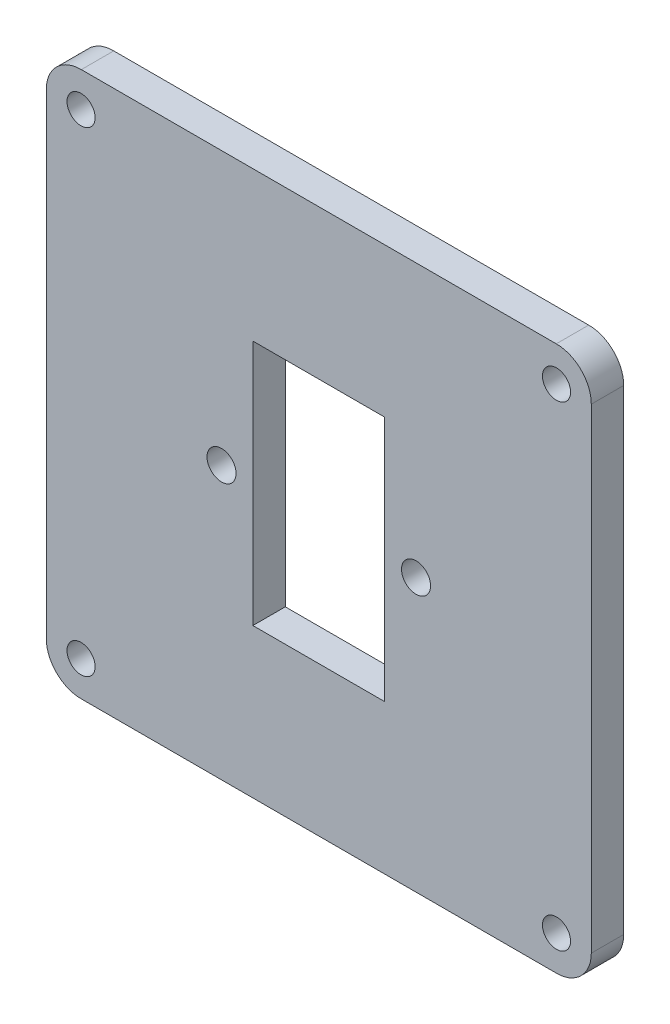
ISO-10303-21;
HEADER;
FILE_DESCRIPTION(('STEP AP214'),'2;1');
FILE_NAME('part.step','',(''),(''),'','','');
FILE_SCHEMA(('AUTOMOTIVE_DESIGN { 1 0 10303 214 1 1 1 1 }'));
ENDSEC;
DATA;
#1=APPLICATION_CONTEXT('core data for automotive mechanical design processes');
#2=APPLICATION_PROTOCOL_DEFINITION('international standard','automotive_design',2000,#1);
#3=PRODUCT_CONTEXT('',#1,'mechanical');
#4=PRODUCT('Part','Part','',(#3));
#5=PRODUCT_RELATED_PRODUCT_CATEGORY('part','',(#4));
#6=PRODUCT_DEFINITION_FORMATION('','',#4);
#7=PRODUCT_DEFINITION_CONTEXT('part definition',#1,'design');
#8=PRODUCT_DEFINITION('design','',#6,#7);
#9=PRODUCT_DEFINITION_SHAPE('','',#8);
#10=(LENGTH_UNIT() NAMED_UNIT(*) SI_UNIT(.MILLI.,.METRE.));
#11=(NAMED_UNIT(*) PLANE_ANGLE_UNIT() SI_UNIT($,.RADIAN.));
#12=(NAMED_UNIT(*) SI_UNIT($,.STERADIAN.) SOLID_ANGLE_UNIT());
#13=UNCERTAINTY_MEASURE_WITH_UNIT(LENGTH_MEASURE(1.E-05),#10,'distance_accuracy_value','');
#14=(GEOMETRIC_REPRESENTATION_CONTEXT(3) GLOBAL_UNCERTAINTY_ASSIGNED_CONTEXT((#13)) GLOBAL_UNIT_ASSIGNED_CONTEXT((#10,
#11,#12)) REPRESENTATION_CONTEXT('',''));
#15=CARTESIAN_POINT('',(0.,0.,0.));
#16=DIRECTION('',(0.,0.,1.));
#17=DIRECTION('',(1.,0.,0.));
#18=AXIS2_PLACEMENT_3D('',#15,#16,#17);
#19=CARTESIAN_POINT('',(69.6162883186586,65.8717779248072,3.));
#20=DIRECTION('',(0.,0.,1.));
#21=DIRECTION('',(1.,0.,0.));
#22=AXIS2_PLACEMENT_3D('',#19,#20,#21);
#23=PLANE('',#22);
#24=CARTESIAN_POINT('',(25.6162883186587,21.8717779248072,3.));
#25=DIRECTION('',(0.,0.,1.));
#26=DIRECTION('',(1.,0.,0.));
#27=AXIS2_PLACEMENT_3D('',#24,#25,#26);
#28=CIRCLE('',#27,1.3);
#29=CARTESIAN_POINT('',(26.9162883186587,21.8717779248072,3.));
#30=VERTEX_POINT('',#29);
#31=EDGE_CURVE('E166',#30,#30,#28,.T.);
#32=ORIENTED_EDGE('',*,*,#31,.F.);
#33=EDGE_LOOP('',(#32));
#34=FACE_BOUND('',#33,.T.);
#35=CARTESIAN_POINT('',(56.6162923684504,43.8721389086082,3.));
#36=DIRECTION('',(0.,0.,1.));
#37=DIRECTION('',(1.,0.,0.));
#38=AXIS2_PLACEMENT_3D('',#35,#36,#37);
#39=CIRCLE('',#38,1.34406779658843);
#40=CARTESIAN_POINT('',(57.9603601650388,43.8721389086082,3.));
#41=VERTEX_POINT('',#40);
#42=EDGE_CURVE('E178',#41,#41,#39,.T.);
#43=ORIENTED_EDGE('',*,*,#42,.F.);
#44=EDGE_LOOP('',(#43));
#45=FACE_BOUND('',#44,.T.);
#46=CARTESIAN_POINT('',(25.6162883186587,65.8717779248072,3.));
#47=DIRECTION('',(0.,0.,1.));
#48=DIRECTION('',(1.,0.,0.));
#49=AXIS2_PLACEMENT_3D('',#46,#47,#48);
#50=CIRCLE('',#49,1.3);
#51=CARTESIAN_POINT('',(26.9162883186587,65.8717779248072,3.));
#52=VERTEX_POINT('',#51);
#53=EDGE_CURVE('E190',#52,#52,#50,.T.);
#54=ORIENTED_EDGE('',*,*,#53,.F.);
#55=EDGE_LOOP('',(#54));
#56=FACE_BOUND('',#55,.T.);
#57=CARTESIAN_POINT('',(69.6162883186586,65.8717779248072,3.));
#58=DIRECTION('',(0.,0.,1.));
#59=DIRECTION('',(1.,0.,0.));
#60=AXIS2_PLACEMENT_3D('',#57,#58,#59);
#61=CIRCLE('',#60,3.21791539875967);
#62=CARTESIAN_POINT('',(72.8342036947718,65.8721596961835,3.));
#63=VERTEX_POINT('',#62);
#64=CARTESIAN_POINT('',(69.5928177896237,69.0896077288586,3.));
#65=VERTEX_POINT('',#64);
#66=EDGE_CURVE('E196',#63,#65,#61,.T.);
#67=ORIENTED_EDGE('',*,*,#66,.T.);
#68=DIRECTION('',(-1.,0.,0.));
#69=VECTOR('',#68,1.);
#70=CARTESIAN_POINT('',(25.6397669472783,69.0896077288586,3.));
#71=LINE('',#70,#69);
#72=CARTESIAN_POINT('',(25.6397669472783,69.0896077288586,3.));
#73=VERTEX_POINT('',#72);
#74=EDGE_CURVE('E199',#65,#73,#71,.T.);
#75=ORIENTED_EDGE('',*,*,#74,.T.);
#76=CARTESIAN_POINT('',(25.6162883186587,65.8717779248072,3.));
#77=DIRECTION('',(0.,0.,1.));
#78=DIRECTION('',(1.,0.,0.));
#79=AXIS2_PLACEMENT_3D('',#76,#77,#78);
#80=CIRCLE('',#79,3.21791545784586);
#81=CARTESIAN_POINT('',(22.3983728810603,65.8721389086082,3.));
#82=VERTEX_POINT('',#81);
#83=EDGE_CURVE('E202',#73,#82,#80,.T.);
#84=ORIENTED_EDGE('',*,*,#83,.T.);
#85=DIRECTION('',(0.,-1.,0.));
#86=VECTOR('',#85,1.);
#87=CARTESIAN_POINT('',(22.3983728810603,21.8721389086082,3.));
#88=LINE('',#87,#86);
#89=CARTESIAN_POINT('',(22.3983728810603,21.8721389086082,3.));
#90=VERTEX_POINT('',#89);
#91=EDGE_CURVE('E204',#82,#90,#88,.T.);
#92=ORIENTED_EDGE('',*,*,#91,.T.);
#93=CARTESIAN_POINT('',(25.6162883186587,21.8717779248072,3.));
#94=DIRECTION('',(0.,0.,1.));
#95=DIRECTION('',(1.,0.,0.));
#96=AXIS2_PLACEMENT_3D('',#93,#94,#95);
#97=CIRCLE('',#96,3.21791545784585);
#98=CARTESIAN_POINT('',(25.6416198760061,18.6539621740151,3.));
#99=VERTEX_POINT('',#98);
#100=EDGE_CURVE('E206',#90,#99,#97,.T.);
#101=ORIENTED_EDGE('',*,*,#100,.T.);
#102=DIRECTION('',(1.,0.,0.));
#103=VECTOR('',#102,1.);
#104=CARTESIAN_POINT('',(69.590964860896,18.6539621740151,3.));
#105=LINE('',#104,#103);
#106=CARTESIAN_POINT('',(69.590964860896,18.6539621740151,3.));
#107=VERTEX_POINT('',#106);
#108=EDGE_CURVE('E208',#99,#107,#105,.T.);
#109=ORIENTED_EDGE('',*,*,#108,.T.);
#110=CARTESIAN_POINT('',(69.6162883186587,21.8717779248072,3.));
#111=DIRECTION('',(0.,0.,1.));
#112=DIRECTION('',(1.,0.,0.));
#113=AXIS2_PLACEMENT_3D('',#110,#111,#112);
#114=CIRCLE('',#113,3.21791539409579);
#115=CARTESIAN_POINT('',(72.8342036947718,21.8721181210328,3.));
#116=VERTEX_POINT('',#115);
#117=EDGE_CURVE('E210',#107,#116,#114,.T.);
#118=ORIENTED_EDGE('',*,*,#117,.T.);
#119=DIRECTION('',(0.,1.,0.));
#120=VECTOR('',#119,1.);
#121=CARTESIAN_POINT('',(72.8342036947718,21.8721181210328,3.));
#122=LINE('',#121,#120);
#123=EDGE_CURVE('E212',#116,#63,#122,.T.);
#124=ORIENTED_EDGE('',*,*,#123,.T.);
#125=EDGE_LOOP('',(#67,#75,#84,#92,#101,#109,#118,#124));
#126=FACE_BOUND('',#125,.T.);
#127=CARTESIAN_POINT('',(69.6162883186586,65.8717779248072,3.));
#128=DIRECTION('',(0.,0.,1.));
#129=DIRECTION('',(1.,0.,0.));
#130=AXIS2_PLACEMENT_3D('',#127,#128,#129);
#131=CIRCLE('',#130,1.29999999999999);
#132=CARTESIAN_POINT('',(70.9162883186586,65.8717779248072,3.));
#133=VERTEX_POINT('',#132);
#134=EDGE_CURVE('E184',#133,#133,#131,.T.);
#135=ORIENTED_EDGE('',*,*,#134,.F.);
#136=EDGE_LOOP('',(#135));
#137=FACE_BOUND('',#136,.T.);
#138=CARTESIAN_POINT('',(38.6162923684504,43.8721389086082,3.));
#139=DIRECTION('',(0.,0.,1.));
#140=DIRECTION('',(1.,0.,0.));
#141=AXIS2_PLACEMENT_3D('',#138,#139,#140);
#142=CIRCLE('',#141,1.34406779658843);
#143=CARTESIAN_POINT('',(39.9603601650388,43.8721389086082,3.));
#144=VERTEX_POINT('',#143);
#145=EDGE_CURVE('E172',#144,#144,#142,.T.);
#146=ORIENTED_EDGE('',*,*,#145,.F.);
#147=EDGE_LOOP('',(#146));
#148=FACE_BOUND('',#147,.T.);
#149=CARTESIAN_POINT('',(69.6162883186587,21.8717779248072,3.));
#150=DIRECTION('',(0.,0.,1.));
#151=DIRECTION('',(1.,0.,0.));
#152=AXIS2_PLACEMENT_3D('',#149,#150,#151);
#153=CIRCLE('',#152,1.29999999999999);
#154=CARTESIAN_POINT('',(70.9162883186587,21.8717779248072,3.));
#155=VERTEX_POINT('',#154);
#156=EDGE_CURVE('E160',#155,#155,#153,.T.);
#157=ORIENTED_EDGE('',*,*,#156,.F.);
#158=EDGE_LOOP('',(#157));
#159=FACE_BOUND('',#158,.T.);
#160=DIRECTION('',(1.,0.,0.));
#161=VECTOR('',#160,1.);
#162=CARTESIAN_POINT('',(53.7162923684504,32.4721389086082,3.));
#163=LINE('',#162,#161);
#164=CARTESIAN_POINT('',(41.5162923684504,32.4721389086082,3.));
#165=VERTEX_POINT('',#164);
#166=CARTESIAN_POINT('',(53.7162923684504,32.4721389086082,3.));
#167=VERTEX_POINT('',#166);
#168=EDGE_CURVE('E132',#165,#167,#163,.T.);
#169=ORIENTED_EDGE('',*,*,#168,.F.);
#170=DIRECTION('',(0.,-1.,0.));
#171=VECTOR('',#170,1.);
#172=CARTESIAN_POINT('',(41.5162923684504,32.4721389086082,3.));
#173=LINE('',#172,#171);
#174=CARTESIAN_POINT('',(41.5162923684504,55.2721389086082,3.));
#175=VERTEX_POINT('',#174);
#176=EDGE_CURVE('E124',#175,#165,#173,.T.);
#177=ORIENTED_EDGE('',*,*,#176,.F.);
#178=DIRECTION('',(-1.,0.,0.));
#179=VECTOR('',#178,1.);
#180=CARTESIAN_POINT('',(41.5162923684504,55.2721389086082,3.));
#181=LINE('',#180,#179);
#182=CARTESIAN_POINT('',(53.7162923684504,55.2721389086082,3.));
#183=VERTEX_POINT('',#182);
#184=EDGE_CURVE('E146',#183,#175,#181,.T.);
#185=ORIENTED_EDGE('',*,*,#184,.F.);
#186=DIRECTION('',(0.,1.,0.));
#187=VECTOR('',#186,1.);
#188=CARTESIAN_POINT('',(53.7162923684504,55.2721389086082,3.));
#189=LINE('',#188,#187);
#190=EDGE_CURVE('E144',#167,#183,#189,.T.);
#191=ORIENTED_EDGE('',*,*,#190,.F.);
#192=EDGE_LOOP('',(#169,#177,#185,#191));
#193=FACE_BOUND('',#192,.T.);
#194=ADVANCED_FACE('F35',(#34,#45,#56,#126,#137,#148,#159,#193),#23,.T.);
#195=CARTESIAN_POINT('',(69.6162883186586,65.8717779248072,0.));
#196=DIRECTION('',(0.,0.,1.));
#197=DIRECTION('',(1.,0.,0.));
#198=AXIS2_PLACEMENT_3D('',#195,#196,#197);
#199=PLANE('',#198);
#200=CARTESIAN_POINT('',(69.6162883186587,21.8717779248072,0.));
#201=DIRECTION('',(0.,0.,1.));
#202=DIRECTION('',(1.,0.,0.));
#203=AXIS2_PLACEMENT_3D('',#200,#201,#202);
#204=CIRCLE('',#203,1.29999999999999);
#205=CARTESIAN_POINT('',(70.9162883186587,21.8717779248072,0.));
#206=VERTEX_POINT('',#205);
#207=EDGE_CURVE('E140',#206,#206,#204,.T.);
#208=ORIENTED_EDGE('',*,*,#207,.T.);
#209=EDGE_LOOP('',(#208));
#210=FACE_BOUND('',#209,.T.);
#211=CARTESIAN_POINT('',(25.6162883186587,21.8717779248072,0.));
#212=DIRECTION('',(0.,0.,1.));
#213=DIRECTION('',(1.,0.,0.));
#214=AXIS2_PLACEMENT_3D('',#211,#212,#213);
#215=CIRCLE('',#214,1.3);
#216=CARTESIAN_POINT('',(26.9162883186587,21.8717779248072,0.));
#217=VERTEX_POINT('',#216);
#218=EDGE_CURVE('E163',#217,#217,#215,.T.);
#219=ORIENTED_EDGE('',*,*,#218,.T.);
#220=EDGE_LOOP('',(#219));
#221=FACE_BOUND('',#220,.T.);
#222=CARTESIAN_POINT('',(38.6162923684504,43.8721389086082,0.));
#223=DIRECTION('',(0.,0.,1.));
#224=DIRECTION('',(1.,0.,0.));
#225=AXIS2_PLACEMENT_3D('',#222,#223,#224);
#226=CIRCLE('',#225,1.34406779658843);
#227=CARTESIAN_POINT('',(39.9603601650388,43.8721389086082,0.));
#228=VERTEX_POINT('',#227);
#229=EDGE_CURVE('E169',#228,#228,#226,.T.);
#230=ORIENTED_EDGE('',*,*,#229,.T.);
#231=EDGE_LOOP('',(#230));
#232=FACE_BOUND('',#231,.T.);
#233=CARTESIAN_POINT('',(56.6162923684504,43.8721389086082,0.));
#234=DIRECTION('',(0.,0.,1.));
#235=DIRECTION('',(1.,0.,0.));
#236=AXIS2_PLACEMENT_3D('',#233,#234,#235);
#237=CIRCLE('',#236,1.34406779658843);
#238=CARTESIAN_POINT('',(57.9603601650388,43.8721389086082,0.));
#239=VERTEX_POINT('',#238);
#240=EDGE_CURVE('E175',#239,#239,#237,.T.);
#241=ORIENTED_EDGE('',*,*,#240,.T.);
#242=EDGE_LOOP('',(#241));
#243=FACE_BOUND('',#242,.T.);
#244=CARTESIAN_POINT('',(69.6162883186586,65.8717779248072,0.));
#245=DIRECTION('',(0.,0.,1.));
#246=DIRECTION('',(1.,0.,0.));
#247=AXIS2_PLACEMENT_3D('',#244,#245,#246);
#248=CIRCLE('',#247,1.29999999999999);
#249=CARTESIAN_POINT('',(70.9162883186586,65.8717779248072,0.));
#250=VERTEX_POINT('',#249);
#251=EDGE_CURVE('E181',#250,#250,#248,.T.);
#252=ORIENTED_EDGE('',*,*,#251,.T.);
#253=EDGE_LOOP('',(#252));
#254=FACE_BOUND('',#253,.T.);
#255=CARTESIAN_POINT('',(25.6162883186587,65.8717779248072,0.));
#256=DIRECTION('',(0.,0.,1.));
#257=DIRECTION('',(1.,0.,0.));
#258=AXIS2_PLACEMENT_3D('',#255,#256,#257);
#259=CIRCLE('',#258,1.3);
#260=CARTESIAN_POINT('',(26.9162883186587,65.8717779248072,0.));
#261=VERTEX_POINT('',#260);
#262=EDGE_CURVE('E187',#261,#261,#259,.T.);
#263=ORIENTED_EDGE('',*,*,#262,.T.);
#264=EDGE_LOOP('',(#263));
#265=FACE_BOUND('',#264,.T.);
#266=CARTESIAN_POINT('',(69.6162883186586,65.8717779248072,0.));
#267=DIRECTION('',(0.,0.,1.));
#268=DIRECTION('',(1.,0.,0.));
#269=AXIS2_PLACEMENT_3D('',#266,#267,#268);
#270=CIRCLE('',#269,3.21791539875967);
#271=CARTESIAN_POINT('',(72.8342036947718,65.8721596961835,0.));
#272=VERTEX_POINT('',#271);
#273=CARTESIAN_POINT('',(69.5928177896237,69.0896077288586,0.));
#274=VERTEX_POINT('',#273);
#275=EDGE_CURVE('E193',#272,#274,#270,.T.);
#276=ORIENTED_EDGE('',*,*,#275,.F.);
#277=DIRECTION('',(0.,1.,0.));
#278=VECTOR('',#277,1.);
#279=CARTESIAN_POINT('',(72.8342036947718,21.8721181210328,0.));
#280=LINE('',#279,#278);
#281=CARTESIAN_POINT('',(72.8342036947718,21.8721181210328,0.));
#282=VERTEX_POINT('',#281);
#283=EDGE_CURVE('E200',#282,#272,#280,.T.);
#284=ORIENTED_EDGE('',*,*,#283,.F.);
#285=CARTESIAN_POINT('',(69.6162883186587,21.8717779248072,0.));
#286=DIRECTION('',(0.,0.,1.));
#287=DIRECTION('',(1.,0.,0.));
#288=AXIS2_PLACEMENT_3D('',#285,#286,#287);
#289=CIRCLE('',#288,3.21791539409579);
#290=CARTESIAN_POINT('',(69.590964860896,18.6539621740151,0.));
#291=VERTEX_POINT('',#290);
#292=EDGE_CURVE('E227',#291,#282,#289,.T.);
#293=ORIENTED_EDGE('',*,*,#292,.F.);
#294=DIRECTION('',(1.,0.,0.));
#295=VECTOR('',#294,1.);
#296=CARTESIAN_POINT('',(69.590964860896,18.6539621740151,0.));
#297=LINE('',#296,#295);
#298=CARTESIAN_POINT('',(25.6416198760061,18.6539621740151,0.));
#299=VERTEX_POINT('',#298);
#300=EDGE_CURVE('E225',#299,#291,#297,.T.);
#301=ORIENTED_EDGE('',*,*,#300,.F.);
#302=CARTESIAN_POINT('',(25.6162883186587,21.8717779248072,0.));
#303=DIRECTION('',(0.,0.,1.));
#304=DIRECTION('',(1.,0.,0.));
#305=AXIS2_PLACEMENT_3D('',#302,#303,#304);
#306=CIRCLE('',#305,3.21791545784585);
#307=CARTESIAN_POINT('',(22.3983728810603,21.8721389086082,0.));
#308=VERTEX_POINT('',#307);
#309=EDGE_CURVE('E223',#308,#299,#306,.T.);
#310=ORIENTED_EDGE('',*,*,#309,.F.);
#311=DIRECTION('',(0.,-1.,0.));
#312=VECTOR('',#311,1.);
#313=CARTESIAN_POINT('',(22.3983728810603,21.8721389086082,0.));
#314=LINE('',#313,#312);
#315=CARTESIAN_POINT('',(22.3983728810603,65.8721389086082,0.));
#316=VERTEX_POINT('',#315);
#317=EDGE_CURVE('E221',#316,#308,#314,.T.);
#318=ORIENTED_EDGE('',*,*,#317,.F.);
#319=CARTESIAN_POINT('',(25.6162883186587,65.8717779248072,0.));
#320=DIRECTION('',(0.,0.,1.));
#321=DIRECTION('',(1.,0.,0.));
#322=AXIS2_PLACEMENT_3D('',#319,#320,#321);
#323=CIRCLE('',#322,3.21791545784586);
#324=CARTESIAN_POINT('',(25.6397669472783,69.0896077288586,0.));
#325=VERTEX_POINT('',#324);
#326=EDGE_CURVE('E219',#325,#316,#323,.T.);
#327=ORIENTED_EDGE('',*,*,#326,.F.);
#328=DIRECTION('',(-1.,0.,0.));
#329=VECTOR('',#328,1.);
#330=CARTESIAN_POINT('',(25.6397669472783,69.0896077288586,0.));
#331=LINE('',#330,#329);
#332=EDGE_CURVE('E217',#274,#325,#331,.T.);
#333=ORIENTED_EDGE('',*,*,#332,.F.);
#334=EDGE_LOOP('',(#276,#284,#293,#301,#310,#318,#327,#333));
#335=FACE_BOUND('',#334,.T.);
#336=DIRECTION('',(0.,-1.,0.));
#337=VECTOR('',#336,1.);
#338=CARTESIAN_POINT('',(41.5162923684504,32.4721389086082,0.));
#339=LINE('',#338,#337);
#340=CARTESIAN_POINT('',(41.5162923684504,55.2721389086082,0.));
#341=VERTEX_POINT('',#340);
#342=CARTESIAN_POINT('',(41.5162923684504,32.4721389086082,0.));
#343=VERTEX_POINT('',#342);
#344=EDGE_CURVE('E58',#341,#343,#339,.T.);
#345=ORIENTED_EDGE('',*,*,#344,.T.);
#346=DIRECTION('',(1.,0.,0.));
#347=VECTOR('',#346,1.);
#348=CARTESIAN_POINT('',(53.7162923684504,32.4721389086082,0.));
#349=LINE('',#348,#347);
#350=CARTESIAN_POINT('',(53.7162923684504,32.4721389086082,0.));
#351=VERTEX_POINT('',#350);
#352=EDGE_CURVE('E139',#343,#351,#349,.T.);
#353=ORIENTED_EDGE('',*,*,#352,.T.);
#354=DIRECTION('',(0.,1.,0.));
#355=VECTOR('',#354,1.);
#356=CARTESIAN_POINT('',(53.7162923684504,55.2721389086082,0.));
#357=LINE('',#356,#355);
#358=CARTESIAN_POINT('',(53.7162923684504,55.2721389086082,0.));
#359=VERTEX_POINT('',#358);
#360=EDGE_CURVE('E152',#351,#359,#357,.T.);
#361=ORIENTED_EDGE('',*,*,#360,.T.);
#362=DIRECTION('',(-1.,0.,0.));
#363=VECTOR('',#362,1.);
#364=CARTESIAN_POINT('',(41.5162923684504,55.2721389086082,0.));
#365=LINE('',#364,#363);
#366=EDGE_CURVE('E133',#359,#341,#365,.T.);
#367=ORIENTED_EDGE('',*,*,#366,.T.);
#368=EDGE_LOOP('',(#345,#353,#361,#367));
#369=FACE_BOUND('',#368,.T.);
#370=ADVANCED_FACE('F257',(#210,#221,#232,#243,#254,#265,#335,#369),#199,.F.);
#371=CARTESIAN_POINT('',(69.6162883186586,65.8717779248072,3.));
#372=DIRECTION('',(0.,0.,-1.));
#373=DIRECTION('',(-1.,0.,0.));
#374=AXIS2_PLACEMENT_3D('',#371,#372,#373);
#375=CYLINDRICAL_SURFACE('',#374,3.21791539875967);
#376=ORIENTED_EDGE('',*,*,#275,.T.);
#377=DIRECTION('',(0.,0.,-1.));
#378=VECTOR('',#377,1.);
#379=CARTESIAN_POINT('',(69.5928177896237,69.0896077288586,3.));
#380=LINE('',#379,#378);
#381=EDGE_CURVE('E11',#65,#274,#380,.T.);
#382=ORIENTED_EDGE('',*,*,#381,.F.);
#383=ORIENTED_EDGE('',*,*,#66,.F.);
#384=DIRECTION('',(0.,0.,-1.));
#385=VECTOR('',#384,1.);
#386=CARTESIAN_POINT('',(72.8342036947718,65.8721596961835,3.));
#387=LINE('',#386,#385);
#388=EDGE_CURVE('E214',#63,#272,#387,.T.);
#389=ORIENTED_EDGE('',*,*,#388,.T.);
#390=EDGE_LOOP('',(#376,#382,#383,#389));
#391=FACE_BOUND('',#390,.T.);
#392=ADVANCED_FACE('F37',(#391),#375,.T.);
#393=CARTESIAN_POINT('',(25.6397669472783,69.0896077288586,3.));
#394=DIRECTION('',(0.,-1.,0.));
#395=DIRECTION('',(1.,0.,0.));
#396=AXIS2_PLACEMENT_3D('',#393,#394,#395);
#397=PLANE('',#396);
#398=ORIENTED_EDGE('',*,*,#332,.T.);
#399=DIRECTION('',(0.,0.,-1.));
#400=VECTOR('',#399,1.);
#401=CARTESIAN_POINT('',(25.6397669472783,69.0896077288586,3.));
#402=LINE('',#401,#400);
#403=EDGE_CURVE('E43',#73,#325,#402,.T.);
#404=ORIENTED_EDGE('',*,*,#403,.F.);
#405=ORIENTED_EDGE('',*,*,#74,.F.);
#406=ORIENTED_EDGE('',*,*,#381,.T.);
#407=EDGE_LOOP('',(#398,#404,#405,#406));
#408=FACE_BOUND('',#407,.T.);
#409=ADVANCED_FACE('F275',(#408),#397,.F.);
#410=CARTESIAN_POINT('',(25.6162883186587,65.8717779248072,3.));
#411=DIRECTION('',(0.,0.,-1.));
#412=DIRECTION('',(-1.,0.,0.));
#413=AXIS2_PLACEMENT_3D('',#410,#411,#412);
#414=CYLINDRICAL_SURFACE('',#413,3.21791545784586);
#415=ORIENTED_EDGE('',*,*,#326,.T.);
#416=DIRECTION('',(0.,0.,-1.));
#417=VECTOR('',#416,1.);
#418=CARTESIAN_POINT('',(22.3983728810603,65.8721389086082,3.));
#419=LINE('',#418,#417);
#420=EDGE_CURVE('E244',#82,#316,#419,.T.);
#421=ORIENTED_EDGE('',*,*,#420,.F.);
#422=ORIENTED_EDGE('',*,*,#83,.F.);
#423=ORIENTED_EDGE('',*,*,#403,.T.);
#424=EDGE_LOOP('',(#415,#421,#422,#423));
#425=FACE_BOUND('',#424,.T.);
#426=ADVANCED_FACE('F251',(#425),#414,.T.);
#427=CARTESIAN_POINT('',(22.3983728810603,21.8721389086082,3.));
#428=DIRECTION('',(1.,0.,0.));
#429=DIRECTION('',(0.,1.,0.));
#430=AXIS2_PLACEMENT_3D('',#427,#428,#429);
#431=PLANE('',#430);
#432=ORIENTED_EDGE('',*,*,#317,.T.);
#433=DIRECTION('',(0.,0.,-1.));
#434=VECTOR('',#433,1.);
#435=CARTESIAN_POINT('',(22.3983728810603,21.8721389086082,3.));
#436=LINE('',#435,#434);
#437=EDGE_CURVE('E241',#90,#308,#436,.T.);
#438=ORIENTED_EDGE('',*,*,#437,.F.);
#439=ORIENTED_EDGE('',*,*,#91,.F.);
#440=ORIENTED_EDGE('',*,*,#420,.T.);
#441=EDGE_LOOP('',(#432,#438,#439,#440));
#442=FACE_BOUND('',#441,.T.);
#443=ADVANCED_FACE('F263',(#442),#431,.F.);
#444=CARTESIAN_POINT('',(25.6162883186587,21.8717779248072,3.));
#445=DIRECTION('',(0.,0.,-1.));
#446=DIRECTION('',(-1.,0.,0.));
#447=AXIS2_PLACEMENT_3D('',#444,#445,#446);
#448=CYLINDRICAL_SURFACE('',#447,3.21791545784585);
#449=ORIENTED_EDGE('',*,*,#309,.T.);
#450=DIRECTION('',(0.,0.,-1.));
#451=VECTOR('',#450,1.);
#452=CARTESIAN_POINT('',(25.6416198760061,18.6539621740151,3.));
#453=LINE('',#452,#451);
#454=EDGE_CURVE('E238',#99,#299,#453,.T.);
#455=ORIENTED_EDGE('',*,*,#454,.F.);
#456=ORIENTED_EDGE('',*,*,#100,.F.);
#457=ORIENTED_EDGE('',*,*,#437,.T.);
#458=EDGE_LOOP('',(#449,#455,#456,#457));
#459=FACE_BOUND('',#458,.T.);
#460=ADVANCED_FACE('F267',(#459),#448,.T.);
#461=CARTESIAN_POINT('',(69.590964860896,18.6539621740151,3.));
#462=DIRECTION('',(0.,1.,0.));
#463=DIRECTION('',(-1.,0.,0.));
#464=AXIS2_PLACEMENT_3D('',#461,#462,#463);
#465=PLANE('',#464);
#466=ORIENTED_EDGE('',*,*,#300,.T.);
#467=DIRECTION('',(0.,0.,-1.));
#468=VECTOR('',#467,1.);
#469=CARTESIAN_POINT('',(69.590964860896,18.6539621740151,3.));
#470=LINE('',#469,#468);
#471=EDGE_CURVE('E235',#107,#291,#470,.T.);
#472=ORIENTED_EDGE('',*,*,#471,.F.);
#473=ORIENTED_EDGE('',*,*,#108,.F.);
#474=ORIENTED_EDGE('',*,*,#454,.T.);
#475=EDGE_LOOP('',(#466,#472,#473,#474));
#476=FACE_BOUND('',#475,.T.);
#477=ADVANCED_FACE('F288',(#476),#465,.F.);
#478=CARTESIAN_POINT('',(69.6162883186587,21.8717779248072,3.));
#479=DIRECTION('',(0.,0.,-1.));
#480=DIRECTION('',(-1.,0.,0.));
#481=AXIS2_PLACEMENT_3D('',#478,#479,#480);
#482=CYLINDRICAL_SURFACE('',#481,3.21791539409579);
#483=ORIENTED_EDGE('',*,*,#292,.T.);
#484=DIRECTION('',(0.,0.,-1.));
#485=VECTOR('',#484,1.);
#486=CARTESIAN_POINT('',(72.8342036947718,21.8721181210328,3.));
#487=LINE('',#486,#485);
#488=EDGE_CURVE('E232',#116,#282,#487,.T.);
#489=ORIENTED_EDGE('',*,*,#488,.F.);
#490=ORIENTED_EDGE('',*,*,#117,.F.);
#491=ORIENTED_EDGE('',*,*,#471,.T.);
#492=EDGE_LOOP('',(#483,#489,#490,#491));
#493=FACE_BOUND('',#492,.T.);
#494=ADVANCED_FACE('F286',(#493),#482,.T.);
#495=CARTESIAN_POINT('',(72.8342036947718,21.8721181210328,3.));
#496=DIRECTION('',(-1.,0.,0.));
#497=DIRECTION('',(0.,-1.,0.));
#498=AXIS2_PLACEMENT_3D('',#495,#496,#497);
#499=PLANE('',#498);
#500=ORIENTED_EDGE('',*,*,#283,.T.);
#501=ORIENTED_EDGE('',*,*,#388,.F.);
#502=ORIENTED_EDGE('',*,*,#123,.F.);
#503=ORIENTED_EDGE('',*,*,#488,.T.);
#504=EDGE_LOOP('',(#500,#501,#502,#503));
#505=FACE_BOUND('',#504,.T.);
#506=ADVANCED_FACE('F281',(#505),#499,.F.);
#507=CARTESIAN_POINT('',(25.6162883186587,65.8717779248072,3.));
#508=DIRECTION('',(0.,0.,-1.));
#509=DIRECTION('',(-1.,0.,0.));
#510=AXIS2_PLACEMENT_3D('',#507,#508,#509);
#511=CYLINDRICAL_SURFACE('',#510,1.3);
#512=ORIENTED_EDGE('',*,*,#53,.T.);
#513=EDGE_LOOP('',(#512));
#514=FACE_BOUND('',#513,.T.);
#515=ORIENTED_EDGE('',*,*,#262,.F.);
#516=EDGE_LOOP('',(#515));
#517=FACE_BOUND('',#516,.T.);
#518=ADVANCED_FACE('F308',(#514,#517),#511,.F.);
#519=CARTESIAN_POINT('',(69.6162883186586,65.8717779248072,3.));
#520=DIRECTION('',(0.,0.,-1.));
#521=DIRECTION('',(-1.,0.,0.));
#522=AXIS2_PLACEMENT_3D('',#519,#520,#521);
#523=CYLINDRICAL_SURFACE('',#522,1.29999999999999);
#524=ORIENTED_EDGE('',*,*,#134,.T.);
#525=EDGE_LOOP('',(#524));
#526=FACE_BOUND('',#525,.T.);
#527=ORIENTED_EDGE('',*,*,#251,.F.);
#528=EDGE_LOOP('',(#527));
#529=FACE_BOUND('',#528,.T.);
#530=ADVANCED_FACE('F315',(#526,#529),#523,.F.);
#531=CARTESIAN_POINT('',(56.6162923684504,43.8721389086082,3.));
#532=DIRECTION('',(0.,0.,-1.));
#533=DIRECTION('',(-1.,0.,0.));
#534=AXIS2_PLACEMENT_3D('',#531,#532,#533);
#535=CYLINDRICAL_SURFACE('',#534,1.34406779658843);
#536=ORIENTED_EDGE('',*,*,#42,.T.);
#537=EDGE_LOOP('',(#536));
#538=FACE_BOUND('',#537,.T.);
#539=ORIENTED_EDGE('',*,*,#240,.F.);
#540=EDGE_LOOP('',(#539));
#541=FACE_BOUND('',#540,.T.);
#542=ADVANCED_FACE('F320',(#538,#541),#535,.F.);
#543=CARTESIAN_POINT('',(38.6162923684504,43.8721389086082,3.));
#544=DIRECTION('',(0.,0.,-1.));
#545=DIRECTION('',(-1.,0.,0.));
#546=AXIS2_PLACEMENT_3D('',#543,#544,#545);
#547=CYLINDRICAL_SURFACE('',#546,1.34406779658843);
#548=ORIENTED_EDGE('',*,*,#145,.T.);
#549=EDGE_LOOP('',(#548));
#550=FACE_BOUND('',#549,.T.);
#551=ORIENTED_EDGE('',*,*,#229,.F.);
#552=EDGE_LOOP('',(#551));
#553=FACE_BOUND('',#552,.T.);
#554=ADVANCED_FACE('F330',(#550,#553),#547,.F.);
#555=CARTESIAN_POINT('',(25.6162883186587,21.8717779248072,3.));
#556=DIRECTION('',(0.,0.,-1.));
#557=DIRECTION('',(-1.,0.,0.));
#558=AXIS2_PLACEMENT_3D('',#555,#556,#557);
#559=CYLINDRICAL_SURFACE('',#558,1.3);
#560=ORIENTED_EDGE('',*,*,#31,.T.);
#561=EDGE_LOOP('',(#560));
#562=FACE_BOUND('',#561,.T.);
#563=ORIENTED_EDGE('',*,*,#218,.F.);
#564=EDGE_LOOP('',(#563));
#565=FACE_BOUND('',#564,.T.);
#566=ADVANCED_FACE('F337',(#562,#565),#559,.F.);
#567=CARTESIAN_POINT('',(69.6162883186587,21.8717779248072,3.));
#568=DIRECTION('',(0.,0.,-1.));
#569=DIRECTION('',(-1.,0.,0.));
#570=AXIS2_PLACEMENT_3D('',#567,#568,#569);
#571=CYLINDRICAL_SURFACE('',#570,1.29999999999999);
#572=ORIENTED_EDGE('',*,*,#156,.T.);
#573=EDGE_LOOP('',(#572));
#574=FACE_BOUND('',#573,.T.);
#575=ORIENTED_EDGE('',*,*,#207,.F.);
#576=EDGE_LOOP('',(#575));
#577=FACE_BOUND('',#576,.T.);
#578=ADVANCED_FACE('F341',(#574,#577),#571,.F.);
#579=CARTESIAN_POINT('',(41.5162923684504,32.4721389086082,3.));
#580=DIRECTION('',(1.,0.,0.));
#581=DIRECTION('',(0.,1.,0.));
#582=AXIS2_PLACEMENT_3D('',#579,#580,#581);
#583=PLANE('',#582);
#584=ORIENTED_EDGE('',*,*,#344,.F.);
#585=DIRECTION('',(0.,0.,-1.));
#586=VECTOR('',#585,1.);
#587=CARTESIAN_POINT('',(41.5162923684504,55.2721389086082,3.));
#588=LINE('',#587,#586);
#589=EDGE_CURVE('E128',#175,#341,#588,.T.);
#590=ORIENTED_EDGE('',*,*,#589,.F.);
#591=ORIENTED_EDGE('',*,*,#176,.T.);
#592=DIRECTION('',(0.,0.,-1.));
#593=VECTOR('',#592,1.);
#594=CARTESIAN_POINT('',(41.5162923684504,32.4721389086082,3.));
#595=LINE('',#594,#593);
#596=EDGE_CURVE('E127',#165,#343,#595,.T.);
#597=ORIENTED_EDGE('',*,*,#596,.T.);
#598=EDGE_LOOP('',(#584,#590,#591,#597));
#599=FACE_BOUND('',#598,.T.);
#600=ADVANCED_FACE('F126',(#599),#583,.T.);
#601=CARTESIAN_POINT('',(53.7162923684504,32.4721389086082,3.));
#602=DIRECTION('',(0.,1.,0.));
#603=DIRECTION('',(-1.,0.,0.));
#604=AXIS2_PLACEMENT_3D('',#601,#602,#603);
#605=PLANE('',#604);
#606=ORIENTED_EDGE('',*,*,#352,.F.);
#607=ORIENTED_EDGE('',*,*,#596,.F.);
#608=ORIENTED_EDGE('',*,*,#168,.T.);
#609=DIRECTION('',(0.,0.,-1.));
#610=VECTOR('',#609,1.);
#611=CARTESIAN_POINT('',(53.7162923684504,32.4721389086082,3.));
#612=LINE('',#611,#610);
#613=EDGE_CURVE('E141',#167,#351,#612,.T.);
#614=ORIENTED_EDGE('',*,*,#613,.T.);
#615=EDGE_LOOP('',(#606,#607,#608,#614));
#616=FACE_BOUND('',#615,.T.);
#617=ADVANCED_FACE('F136',(#616),#605,.T.);
#618=CARTESIAN_POINT('',(53.7162923684504,55.2721389086082,3.));
#619=DIRECTION('',(-1.,0.,0.));
#620=DIRECTION('',(0.,-1.,0.));
#621=AXIS2_PLACEMENT_3D('',#618,#619,#620);
#622=PLANE('',#621);
#623=ORIENTED_EDGE('',*,*,#360,.F.);
#624=ORIENTED_EDGE('',*,*,#613,.F.);
#625=ORIENTED_EDGE('',*,*,#190,.T.);
#626=DIRECTION('',(0.,0.,-1.));
#627=VECTOR('',#626,1.);
#628=CARTESIAN_POINT('',(53.7162923684504,55.2721389086082,3.));
#629=LINE('',#628,#627);
#630=EDGE_CURVE('E50',#183,#359,#629,.T.);
#631=ORIENTED_EDGE('',*,*,#630,.T.);
#632=EDGE_LOOP('',(#623,#624,#625,#631));
#633=FACE_BOUND('',#632,.T.);
#634=ADVANCED_FACE('F350',(#633),#622,.T.);
#635=CARTESIAN_POINT('',(41.5162923684504,55.2721389086082,3.));
#636=DIRECTION('',(0.,-1.,0.));
#637=DIRECTION('',(0.,0.,-1.));
#638=AXIS2_PLACEMENT_3D('',#635,#636,#637);
#639=PLANE('',#638);
#640=ORIENTED_EDGE('',*,*,#366,.F.);
#641=ORIENTED_EDGE('',*,*,#630,.F.);
#642=ORIENTED_EDGE('',*,*,#184,.T.);
#643=ORIENTED_EDGE('',*,*,#589,.T.);
#644=EDGE_LOOP('',(#640,#641,#642,#643));
#645=FACE_BOUND('',#644,.T.);
#646=ADVANCED_FACE('F353',(#645),#639,.T.);
#647=CLOSED_SHELL('',(#194,#370,#392,#409,#426,#443,#460,#477,#494,#506,#518,#530,#542,#554,
#566,#578,#600,#617,#634,#646));
#648=MANIFOLD_SOLID_BREP('B2',#647);
#649=ADVANCED_BREP_SHAPE_REPRESENTATION('',(#18,#648),#14);
#650=SHAPE_DEFINITION_REPRESENTATION(#9,#649);
ENDSEC;
END-ISO-10303-21;
